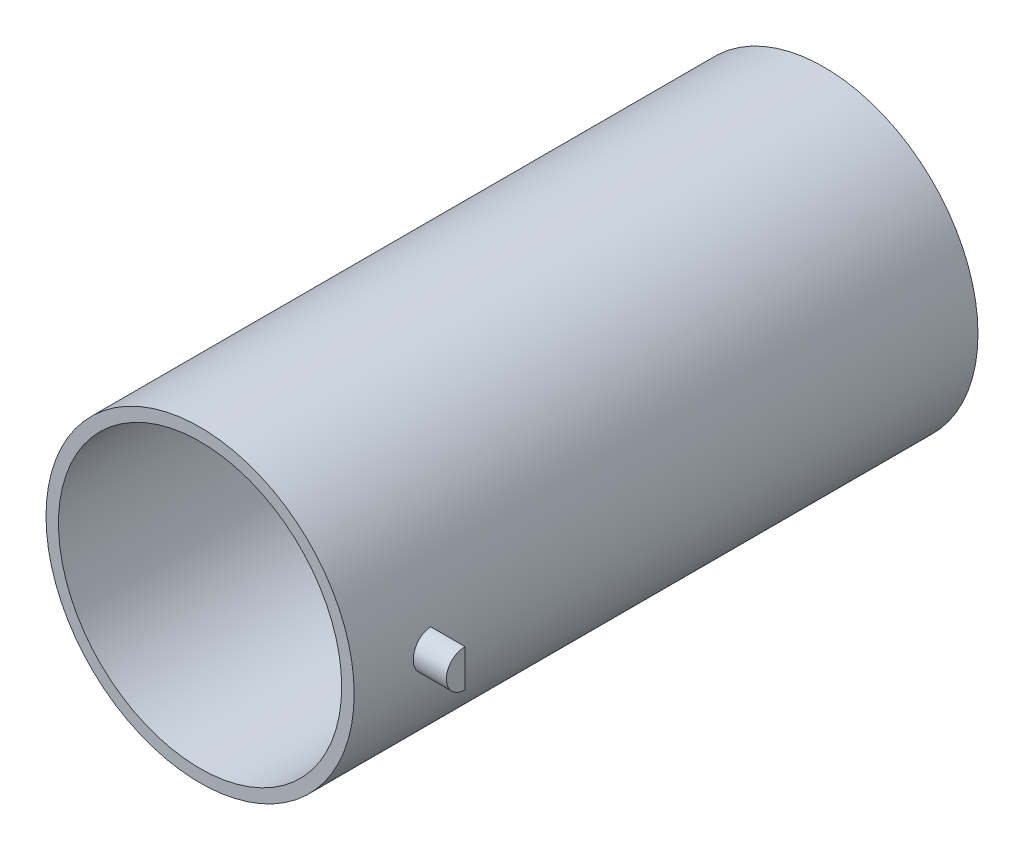
ISO-10303-21;
HEADER;
FILE_DESCRIPTION(('STEP AP214'),'2;1');
FILE_NAME('part.step','',(''),(''),'','','');
FILE_SCHEMA(('AUTOMOTIVE_DESIGN { 1 0 10303 214 1 1 1 1 }'));
ENDSEC;
DATA;
#1=APPLICATION_CONTEXT('core data for automotive mechanical design processes');
#2=APPLICATION_PROTOCOL_DEFINITION('international standard','automotive_design',2000,#1);
#3=PRODUCT_CONTEXT('',#1,'mechanical');
#4=PRODUCT('Part','Part','',(#3));
#5=PRODUCT_RELATED_PRODUCT_CATEGORY('part','',(#4));
#6=PRODUCT_DEFINITION_FORMATION('','',#4);
#7=PRODUCT_DEFINITION_CONTEXT('part definition',#1,'design');
#8=PRODUCT_DEFINITION('design','',#6,#7);
#9=PRODUCT_DEFINITION_SHAPE('','',#8);
#10=(LENGTH_UNIT() NAMED_UNIT(*) SI_UNIT(.MILLI.,.METRE.));
#11=(NAMED_UNIT(*) PLANE_ANGLE_UNIT() SI_UNIT($,.RADIAN.));
#12=(NAMED_UNIT(*) SI_UNIT($,.STERADIAN.) SOLID_ANGLE_UNIT());
#13=UNCERTAINTY_MEASURE_WITH_UNIT(LENGTH_MEASURE(1.E-05),#10,'distance_accuracy_value','');
#14=(GEOMETRIC_REPRESENTATION_CONTEXT(3) GLOBAL_UNCERTAINTY_ASSIGNED_CONTEXT((#13)) GLOBAL_UNIT_ASSIGNED_CONTEXT((#10,
#11,#12)) REPRESENTATION_CONTEXT('',''));
#15=CARTESIAN_POINT('',(0.,0.,0.));
#16=DIRECTION('',(0.,0.,1.));
#17=DIRECTION('',(1.,0.,0.));
#18=AXIS2_PLACEMENT_3D('',#15,#16,#17);
#19=CARTESIAN_POINT('',(0.,0.,127.));
#20=DIRECTION('',(0.,0.,-1.));
#21=DIRECTION('',(-1.,0.,0.));
#22=AXIS2_PLACEMENT_3D('',#19,#20,#21);
#23=CYLINDRICAL_SURFACE('',#22,31.369);
#24=CARTESIAN_POINT('',(31.369,0.,114.971571782048));
#25=CARTESIAN_POINT('',(31.3689970955781,-0.213167364051595,114.971562696366));
#26=CARTESIAN_POINT('',(31.3668041688606,-0.426469134178788,114.953621584882));
#27=CARTESIAN_POINT('',(31.3582670744274,-0.847140611326079,114.882332263245));
#28=CARTESIAN_POINT('',(31.3519185351752,-1.05450383120011,114.828946766184));
#29=CARTESIAN_POINT('',(31.3357856363385,-1.4571469626942,114.688361817618));
#30=CARTESIAN_POINT('',(31.3260035532145,-1.65243477972668,114.601184766134));
#31=CARTESIAN_POINT('',(31.3040924359266,-2.02557016512767,114.395539517755));
#32=CARTESIAN_POINT('',(31.291963814335,-2.20342079106323,114.277076820223));
#33=CARTESIAN_POINT('',(31.2666438013514,-2.53759790009,114.011562760453));
#34=CARTESIAN_POINT('',(31.253447731094,-2.69382046896116,113.864381044467));
#35=CARTESIAN_POINT('',(31.2275179720887,-2.97941219391668,113.545886574842));
#36=CARTESIAN_POINT('',(31.2147843065805,-3.10878000186274,113.374572610462));
#37=CARTESIAN_POINT('',(31.1911748513728,-3.33737435755847,113.012004774136));
#38=CARTESIAN_POINT('',(31.1803050818292,-3.43650401390402,112.820689387646));
#39=CARTESIAN_POINT('',(31.1617153825556,-3.6011893919571,112.423972878325));
#40=CARTESIAN_POINT('',(31.1539953399082,-3.66674631726484,112.218572260756));
#41=CARTESIAN_POINT('',(31.142623578278,-3.76211060558043,111.800591925058));
#42=CARTESIAN_POINT('',(31.1389519443873,-3.79209302247592,111.588052697548));
#43=CARTESIAN_POINT('',(31.1360316605245,-3.8159987951884,111.160929913887));
#44=CARTESIAN_POINT('',(31.1367828422859,-3.80992352282403,110.94634643582));
#45=CARTESIAN_POINT('',(31.1426050935601,-3.76203015742701,110.522444301279));
#46=CARTESIAN_POINT('',(31.1476528891808,-3.7204046288957,110.313103523438));
#47=CARTESIAN_POINT('',(31.1614633040205,-3.60289266751102,109.904400777028));
#48=CARTESIAN_POINT('',(31.1702259946537,-3.52700557602057,109.705039000375));
#49=CARTESIAN_POINT('',(31.1905053216013,-3.34291680592955,109.321353620315));
#50=CARTESIAN_POINT('',(31.2020290968153,-3.23463117599408,109.137070688699));
#51=CARTESIAN_POINT('',(31.2265265642595,-2.98887925657692,108.78921969431));
#52=CARTESIAN_POINT('',(31.2395003191065,-2.85141170665659,108.625652526788));
#53=CARTESIAN_POINT('',(31.2655394389436,-2.55012965719149,108.322758226094));
#54=CARTESIAN_POINT('',(31.2786048494192,-2.38614912658694,108.183596190874));
#55=CARTESIAN_POINT('',(31.3032758453628,-2.03706833621165,107.93474703181));
#56=CARTESIAN_POINT('',(31.3148814277768,-1.85196803225926,107.825059969628));
#57=CARTESIAN_POINT('',(31.3353317713395,-1.46577669593737,107.638275293854));
#58=CARTESIAN_POINT('',(31.3441756822835,-1.26468076303405,107.561187713715));
#59=CARTESIAN_POINT('',(31.3580983812159,-0.852267813359166,107.441919735353));
#60=CARTESIAN_POINT('',(31.363177335567,-0.640951248648288,107.399737794738));
#61=CARTESIAN_POINT('',(31.3689762787509,-0.215523396717518,107.351691762585));
#62=CARTESIAN_POINT('',(31.3697235710167,-0.00143815874187753,107.345600180067));
#63=CARTESIAN_POINT('',(31.3668486306061,0.424702131578445,107.369307871813));
#64=CARTESIAN_POINT('',(31.3632264856713,0.636757224603814,107.399106425375));
#65=CARTESIAN_POINT('',(31.3520367343606,1.05214877665922,107.493559567637));
#66=CARTESIAN_POINT('',(31.3444813742867,1.25551018933141,107.558105987913));
#67=CARTESIAN_POINT('',(31.3262713206488,1.64852160489971,107.720110370148));
#68=CARTESIAN_POINT('',(31.3156165272328,1.83817116580638,107.817569392442));
#69=CARTESIAN_POINT('',(31.2923279996241,2.19939336582821,108.04318500586));
#70=CARTESIAN_POINT('',(31.279684860002,2.37087325259756,108.171489110906));
#71=CARTESIAN_POINT('',(31.2538641968051,2.68994549408777,108.454943681751));
#72=CARTESIAN_POINT('',(31.2406866532592,2.8375369550456,108.610095151568));
#73=CARTESIAN_POINT('',(31.2151984492689,3.10544723955395,108.943840916483));
#74=CARTESIAN_POINT('',(31.2028928191322,3.22561549187931,109.12255652063));
#75=CARTESIAN_POINT('',(31.1806235764868,3.43422881311563,109.497767329609));
#76=CARTESIAN_POINT('',(31.1706599192583,3.52267448778491,109.694262194849));
#77=CARTESIAN_POINT('',(31.15423662668,3.66508694321304,110.098963206997));
#78=CARTESIAN_POINT('',(31.1477682962238,3.71913934205776,110.307138857441));
#79=CARTESIAN_POINT('',(31.1390427977439,3.79150695747354,110.729695193466));
#80=CARTESIAN_POINT('',(31.1367854456211,3.80982373636615,110.944075607367));
#81=CARTESIAN_POINT('',(31.1367426383494,3.81017259067306,111.371458271235));
#82=CARTESIAN_POINT('',(31.1389280304988,3.79244120932643,111.584460364024));
#83=CARTESIAN_POINT('',(31.1474618780662,3.72169721326812,112.004433478009));
#84=CARTESIAN_POINT('',(31.1538103346845,3.66868458838558,112.211404497466));
#85=CARTESIAN_POINT('',(31.1699461292312,3.52895559782069,112.613413656303));
#86=CARTESIAN_POINT('',(31.179732373105,3.44224995380232,112.80845556889));
#87=CARTESIAN_POINT('',(31.2016429542723,3.23761953079512,113.181259100314));
#88=CARTESIAN_POINT('',(31.2137673143747,3.11969444724996,113.359020550551));
#89=CARTESIAN_POINT('',(31.239083370723,2.85509302836648,113.693427024122));
#90=CARTESIAN_POINT('',(31.2522813068443,2.70824033379213,113.849932038452));
#91=CARTESIAN_POINT('',(31.2782020012869,2.39031840634084,114.136170008032));
#92=CARTESIAN_POINT('',(31.2909246465852,2.21924345922273,114.265896628225));
#93=CARTESIAN_POINT('',(31.3145114549127,1.85703116144723,114.495289023414));
#94=CARTESIAN_POINT('',(31.3253687682306,1.66582385841211,114.594844988873));
#95=CARTESIAN_POINT('',(31.3439316042907,1.26938229844139,114.760294378611));
#96=CARTESIAN_POINT('',(31.3516405699763,1.06416365222346,114.826224594798));
#97=CARTESIAN_POINT('',(31.3611675226217,0.714889337163812,114.906666709973));
#98=CARTESIAN_POINT('',(31.3640904880335,0.573041222199046,114.930971402178));
#99=CARTESIAN_POINT('',(31.3680076995963,0.287482442988227,114.963426947069));
#100=CARTESIAN_POINT('',(31.3690019589019,0.143771791452228,114.971577909932));
#101=CARTESIAN_POINT('',(31.369,0.,114.971571782048));
#102=B_SPLINE_CURVE_WITH_KNOTS('',3,(#24,#25,#26,#27,#28,#29,#30,#31,#32,#33,#34,#35,#36,#37,
#38,#39,#40,#41,#42,#43,#44,#45,#46,#47,#48,#49,#50,#51,#52,#53,#54,#55,#56,#57,#58,#59,#60,#61,
#62,#63,#64,#65,#66,#67,#68,#69,#70,#71,#72,#73,#74,#75,#76,#77,#78,#79,#80,#81,#82,#83,#84,#85,
#86,#87,#88,#89,#90,#91,#92,#93,#94,#95,#96,#97,#98,#99,#100,#101),.UNSPECIFIED.,.T.,.F.,(4,2,2,
2,2,2,2,2,2,2,2,2,2,2,2,2,2,2,2,2,2,2,2,2,2,2,2,2,2,2,2,2,2,2,2,2,2,2,4),(0.,0.63897696331118,
1.27862718717995,1.9178541176241,2.55696876003608,3.19905477212243,3.84117300983587,
4.48532766669679,5.1294592286547,5.7704078471223,6.41133208078783,7.04880649035596,
7.68629315511984,8.32544620084571,8.96462685877694,9.60797738901365,10.2513292651359,
10.8948790079109,11.5384003123299,12.1778609096841,12.8173086663914,13.4547772674503,
14.0922664075942,14.7328671529878,15.3734918603197,16.0175536383617,16.6616031170699,
17.3040429709352,17.946454737415,18.5846646904379,19.2228748274439,19.8608820417452,
20.4988954802549,21.1409262224824,21.7831086785175,22.4276011108777,23.0713868451585,
23.502350983125,23.9333121817151),.UNSPECIFIED.);
#103=CARTESIAN_POINT('',(31.13676381707,3.81,111.161571782048));
#104=VERTEX_POINT('',#103);
#105=CARTESIAN_POINT('',(31.13676381707,-3.81,111.161571782048));
#106=VERTEX_POINT('',#105);
#107=EDGE_CURVE('E112',#104,#106,#102,.T.);
#108=ORIENTED_EDGE('',*,*,#107,.F.);
#109=CARTESIAN_POINT('',(0.,0.,111.161571782048));
#110=DIRECTION('',(0.,0.,1.));
#111=DIRECTION('',(1.,0.,0.));
#112=AXIS2_PLACEMENT_3D('',#109,#110,#111);
#113=CIRCLE('',#112,31.369);
#114=EDGE_CURVE('E57',#106,#104,#113,.T.);
#115=ORIENTED_EDGE('',*,*,#114,.F.);
#116=EDGE_LOOP('',(#108,#115));
#117=FACE_BOUND('',#116,.T.);
#118=CARTESIAN_POINT('',(0.,0.,127.));
#119=DIRECTION('',(0.,0.,1.));
#120=DIRECTION('',(1.,0.,0.));
#121=AXIS2_PLACEMENT_3D('',#118,#119,#120);
#122=CIRCLE('',#121,31.369);
#123=CARTESIAN_POINT('',(31.369,0.,127.));
#124=VERTEX_POINT('',#123);
#125=EDGE_CURVE('E107',#124,#124,#122,.T.);
#126=ORIENTED_EDGE('',*,*,#125,.F.);
#127=EDGE_LOOP('',(#126));
#128=FACE_BOUND('',#127,.T.);
#129=CARTESIAN_POINT('',(0.,0.,0.));
#130=DIRECTION('',(0.,0.,1.));
#131=DIRECTION('',(1.,0.,0.));
#132=AXIS2_PLACEMENT_3D('',#129,#130,#131);
#133=CIRCLE('',#132,31.369);
#134=CARTESIAN_POINT('',(31.369,0.,0.));
#135=VERTEX_POINT('',#134);
#136=EDGE_CURVE('E106',#135,#135,#133,.T.);
#137=ORIENTED_EDGE('',*,*,#136,.T.);
#138=EDGE_LOOP('',(#137));
#139=FACE_BOUND('',#138,.T.);
#140=CARTESIAN_POINT('',(-31.369,0.,114.971571782048));
#141=CARTESIAN_POINT('',(-31.3689970955781,0.213167364051582,114.971562696366));
#142=CARTESIAN_POINT('',(-31.3668041688606,0.426469134178775,114.953621584882));
#143=CARTESIAN_POINT('',(-31.3582670744275,0.847140611326068,114.882332263245));
#144=CARTESIAN_POINT('',(-31.3519185351752,1.0545038312001,114.828946766184));
#145=CARTESIAN_POINT('',(-31.3357856363385,1.45714696269418,114.688361817618));
#146=CARTESIAN_POINT('',(-31.3260035532146,1.65243477972666,114.601184766134));
#147=CARTESIAN_POINT('',(-31.3040924359266,2.02557016512765,114.395539517755));
#148=CARTESIAN_POINT('',(-31.291963814335,2.20342079106321,114.277076820223));
#149=CARTESIAN_POINT('',(-31.2666438013514,2.53759790008999,114.011562760453));
#150=CARTESIAN_POINT('',(-31.253447731094,2.69382046896115,113.864381044467));
#151=CARTESIAN_POINT('',(-31.2275179720887,2.97941219391666,113.545886574842));
#152=CARTESIAN_POINT('',(-31.2147843065805,3.10878000186272,113.374572610462));
#153=CARTESIAN_POINT('',(-31.1911748513728,3.33737435755846,113.012004774136));
#154=CARTESIAN_POINT('',(-31.1803050818292,3.436504013904,112.820689387646));
#155=CARTESIAN_POINT('',(-31.1617153825556,3.60118939195708,112.423972878325));
#156=CARTESIAN_POINT('',(-31.1539953399082,3.66674631726482,112.218572260756));
#157=CARTESIAN_POINT('',(-31.1426235782781,3.76211060558041,111.800591925058));
#158=CARTESIAN_POINT('',(-31.1389519443873,3.7920930224759,111.588052697548));
#159=CARTESIAN_POINT('',(-31.1360316605245,3.81599879518838,111.160929913887));
#160=CARTESIAN_POINT('',(-31.1367828422859,3.809923522824,110.94634643582));
#161=CARTESIAN_POINT('',(-31.1426050935601,3.76203015742698,110.522444301279));
#162=CARTESIAN_POINT('',(-31.1476528891808,3.72040462889567,110.313103523438));
#163=CARTESIAN_POINT('',(-31.1614633040205,3.60289266751099,109.904400777028));
#164=CARTESIAN_POINT('',(-31.1702259946537,3.52700557602053,109.705039000375));
#165=CARTESIAN_POINT('',(-31.1905053216013,3.34291680592951,109.321353620315));
#166=CARTESIAN_POINT('',(-31.2020290968153,3.23463117599404,109.137070688699));
#167=CARTESIAN_POINT('',(-31.2265265642595,2.98887925657688,108.78921969431));
#168=CARTESIAN_POINT('',(-31.2395003191065,2.85141170665655,108.625652526788));
#169=CARTESIAN_POINT('',(-31.2655394389436,2.55012965719145,108.322758226094));
#170=CARTESIAN_POINT('',(-31.2786048494192,2.3861491265869,108.183596190874));
#171=CARTESIAN_POINT('',(-31.3032758453628,2.0370683362116,107.93474703181));
#172=CARTESIAN_POINT('',(-31.3148814277768,1.85196803225922,107.825059969628));
#173=CARTESIAN_POINT('',(-31.3353317713395,1.46577669593732,107.638275293854));
#174=CARTESIAN_POINT('',(-31.3441756822835,1.264680763034,107.561187713715));
#175=CARTESIAN_POINT('',(-31.3580983812159,0.852267813359124,107.441919735353));
#176=CARTESIAN_POINT('',(-31.363177335567,0.640951248648247,107.399737794738));
#177=CARTESIAN_POINT('',(-31.3689762787509,0.215523396717477,107.351691762585));
#178=CARTESIAN_POINT('',(-31.3697235710167,0.00143815874183549,107.345600180067));
#179=CARTESIAN_POINT('',(-31.3668486306061,-0.424702131578489,107.369307871813));
#180=CARTESIAN_POINT('',(-31.3632264856713,-0.636757224603858,107.399106425375));
#181=CARTESIAN_POINT('',(-31.3520367343606,-1.05214877665926,107.493559567637));
#182=CARTESIAN_POINT('',(-31.3444813742868,-1.25551018933145,107.558105987913));
#183=CARTESIAN_POINT('',(-31.3262713206488,-1.64852160489975,107.720110370148));
#184=CARTESIAN_POINT('',(-31.3156165272328,-1.83817116580643,107.817569392442));
#185=CARTESIAN_POINT('',(-31.2923279996241,-2.19939336582825,108.04318500586));
#186=CARTESIAN_POINT('',(-31.279684860002,-2.3708732525976,108.171489110906));
#187=CARTESIAN_POINT('',(-31.2538641968051,-2.68994549408781,108.454943681751));
#188=CARTESIAN_POINT('',(-31.2406866532592,-2.83753695504564,108.610095151568));
#189=CARTESIAN_POINT('',(-31.2151984492689,-3.10544723955398,108.943840916483));
#190=CARTESIAN_POINT('',(-31.2028928191322,-3.22561549187934,109.12255652063));
#191=CARTESIAN_POINT('',(-31.1806235764868,-3.43422881311566,109.497767329609));
#192=CARTESIAN_POINT('',(-31.1706599192583,-3.52267448778495,109.694262194849));
#193=CARTESIAN_POINT('',(-31.15423662668,-3.66508694321307,110.098963206997));
#194=CARTESIAN_POINT('',(-31.1477682962238,-3.71913934205779,110.307138857441));
#195=CARTESIAN_POINT('',(-31.1390427977439,-3.79150695747357,110.729695193466));
#196=CARTESIAN_POINT('',(-31.1367854456211,-3.80982373636618,110.944075607367));
#197=CARTESIAN_POINT('',(-31.1367426383494,-3.81017259067308,111.371458271235));
#198=CARTESIAN_POINT('',(-31.1389280304988,-3.79244120932645,111.584460364024));
#199=CARTESIAN_POINT('',(-31.1474618780662,-3.72169721326814,112.004433478009));
#200=CARTESIAN_POINT('',(-31.1538103346845,-3.6686845883856,112.211404497466));
#201=CARTESIAN_POINT('',(-31.1699461292312,-3.52895559782071,112.613413656303));
#202=CARTESIAN_POINT('',(-31.179732373105,-3.44224995380234,112.80845556889));
#203=CARTESIAN_POINT('',(-31.2016429542723,-3.23761953079514,113.181259100314));
#204=CARTESIAN_POINT('',(-31.2137673143747,-3.11969444724997,113.359020550551));
#205=CARTESIAN_POINT('',(-31.239083370723,-2.8550930283665,113.693427024122));
#206=CARTESIAN_POINT('',(-31.2522813068443,-2.70824033379214,113.849932038452));
#207=CARTESIAN_POINT('',(-31.2782020012869,-2.39031840634085,114.136170008032));
#208=CARTESIAN_POINT('',(-31.2909246465852,-2.21924345922274,114.265896628225));
#209=CARTESIAN_POINT('',(-31.3145114549127,-1.85703116144723,114.495289023414));
#210=CARTESIAN_POINT('',(-31.3253687682306,-1.66582385841212,114.594844988873));
#211=CARTESIAN_POINT('',(-31.3439316042907,-1.2693822984414,114.760294378611));
#212=CARTESIAN_POINT('',(-31.3516405699763,-1.06416365222347,114.826224594798));
#213=CARTESIAN_POINT('',(-31.3611675226217,-0.714889337163828,114.906666709973));
#214=CARTESIAN_POINT('',(-31.3640904880335,-0.573041222199062,114.930971402178));
#215=CARTESIAN_POINT('',(-31.3680076995963,-0.287482442988242,114.963426947069));
#216=CARTESIAN_POINT('',(-31.3690019589019,-0.143771791452242,114.971577909932));
#217=CARTESIAN_POINT('',(-31.369,0.,114.971571782048));
#218=B_SPLINE_CURVE_WITH_KNOTS('',3,(#140,#141,#142,#143,#144,#145,#146,#147,#148,#149,#150,
#151,#152,#153,#154,#155,#156,#157,#158,#159,#160,#161,#162,#163,#164,#165,#166,#167,#168,#169,
#170,#171,#172,#173,#174,#175,#176,#177,#178,#179,#180,#181,#182,#183,#184,#185,#186,#187,#188,
#189,#190,#191,#192,#193,#194,#195,#196,#197,#198,#199,#200,#201,#202,#203,#204,#205,#206,#207,
#208,#209,#210,#211,#212,#213,#214,#215,#216,#217),.UNSPECIFIED.,.T.,.F.,(4,2,2,2,2,2,2,2,2,2,2,
2,2,2,2,2,2,2,2,2,2,2,2,2,2,2,2,2,2,2,2,2,2,2,2,2,2,2,4),(0.,0.638976963311181,1.27862718717996,
1.9178541176241,2.55696876003608,3.19905477212244,3.84117300983588,4.4853276666968,
5.12945922865472,5.77040784712231,6.41133208078784,7.04880649035596,7.68629315511984,
8.32544620084572,8.96462685877695,9.60797738901366,10.2513292651359,10.8948790079109,
11.5384003123299,12.1778609096841,12.8173086663914,13.4547772674503,14.0922664075942,
14.7328671529878,15.3734918603197,16.0175536383616,16.6616031170699,17.3040429709352,
17.946454737415,18.5846646904379,19.2228748274439,19.8608820417453,20.4988954802549,
21.1409262224824,21.7831086785175,22.4276011108777,23.0713868451585,23.502350983125,
23.9333121817151),.UNSPECIFIED.);
#219=CARTESIAN_POINT('',(-31.13676381707,-3.81,111.161571782048));
#220=VERTEX_POINT('',#219);
#221=CARTESIAN_POINT('',(-31.13676381707,3.81,111.161571782048));
#222=VERTEX_POINT('',#221);
#223=EDGE_CURVE('E11',#220,#222,#218,.T.);
#224=ORIENTED_EDGE('',*,*,#223,.F.);
#225=EDGE_CURVE('E46',#222,#220,#113,.T.);
#226=ORIENTED_EDGE('',*,*,#225,.F.);
#227=EDGE_LOOP('',(#224,#226));
#228=FACE_BOUND('',#227,.T.);
#229=ADVANCED_FACE('F35',(#117,#128,#139,#228),#23,.T.);
#230=CARTESIAN_POINT('',(0.,0.,127.));
#231=DIRECTION('',(0.,0.,1.));
#232=DIRECTION('',(1.,0.,0.));
#233=AXIS2_PLACEMENT_3D('',#230,#231,#232);
#234=PLANE('',#233);
#235=CARTESIAN_POINT('',(0.,0.,127.));
#236=DIRECTION('',(0.,0.,1.));
#237=DIRECTION('',(1.,0.,0.));
#238=AXIS2_PLACEMENT_3D('',#235,#236,#237);
#239=CIRCLE('',#238,28.829);
#240=CARTESIAN_POINT('',(28.829,0.,127.));
#241=VERTEX_POINT('',#240);
#242=EDGE_CURVE('E92',#241,#241,#239,.T.);
#243=ORIENTED_EDGE('',*,*,#242,.F.);
#244=EDGE_LOOP('',(#243));
#245=FACE_BOUND('',#244,.T.);
#246=ORIENTED_EDGE('',*,*,#125,.T.);
#247=EDGE_LOOP('',(#246));
#248=FACE_BOUND('',#247,.T.);
#249=ADVANCED_FACE('F122',(#245,#248),#234,.T.);
#250=CARTESIAN_POINT('',(0.,0.,0.));
#251=DIRECTION('',(0.,0.,1.));
#252=DIRECTION('',(1.,0.,0.));
#253=AXIS2_PLACEMENT_3D('',#250,#251,#252);
#254=PLANE('',#253);
#255=ORIENTED_EDGE('',*,*,#136,.F.);
#256=EDGE_LOOP('',(#255));
#257=FACE_BOUND('',#256,.T.);
#258=ADVANCED_FACE('F125',(#257),#254,.F.);
#259=CARTESIAN_POINT('',(38.1,0.,111.161571782048));
#260=DIRECTION('',(1.,0.,0.));
#261=DIRECTION('',(0.,0.,-1.));
#262=AXIS2_PLACEMENT_3D('',#259,#260,#261);
#263=PLANE('',#262);
#264=CARTESIAN_POINT('',(38.1,0.,111.161571782048));
#265=DIRECTION('',(1.,0.,0.));
#266=DIRECTION('',(0.,0.,-1.));
#267=AXIS2_PLACEMENT_3D('',#264,#265,#266);
#268=CIRCLE('',#267,3.81);
#269=CARTESIAN_POINT('',(38.1,3.81,111.161571782048));
#270=VERTEX_POINT('',#269);
#271=CARTESIAN_POINT('',(38.1,-3.81,111.161571782048));
#272=VERTEX_POINT('',#271);
#273=EDGE_CURVE('E95',#270,#272,#268,.T.);
#274=ORIENTED_EDGE('',*,*,#273,.T.);
#275=DIRECTION('',(0.,1.,0.));
#276=VECTOR('',#275,1.);
#277=CARTESIAN_POINT('',(38.1,3.81,111.161571782048));
#278=LINE('',#277,#276);
#279=EDGE_CURVE('E98',#272,#270,#278,.T.);
#280=ORIENTED_EDGE('',*,*,#279,.T.);
#281=EDGE_LOOP('',(#274,#280));
#282=FACE_BOUND('',#281,.T.);
#283=ADVANCED_FACE('F128',(#282),#263,.T.);
#284=CARTESIAN_POINT('',(38.1,3.81,111.161571782048));
#285=DIRECTION('',(0.,0.,1.));
#286=DIRECTION('',(1.,0.,0.));
#287=AXIS2_PLACEMENT_3D('',#284,#285,#286);
#288=PLANE('',#287);
#289=DIRECTION('',(-1.,0.,0.));
#290=VECTOR('',#289,1.);
#291=CARTESIAN_POINT('',(38.1,-3.81,111.161571782048));
#292=LINE('',#291,#290);
#293=EDGE_CURVE('E84',#272,#106,#292,.T.);
#294=ORIENTED_EDGE('',*,*,#293,.T.);
#295=ORIENTED_EDGE('',*,*,#114,.T.);
#296=DIRECTION('',(-1.,0.,0.));
#297=VECTOR('',#296,1.);
#298=CARTESIAN_POINT('',(38.1,3.81,111.161571782048));
#299=LINE('',#298,#297);
#300=EDGE_CURVE('E85',#270,#104,#299,.T.);
#301=ORIENTED_EDGE('',*,*,#300,.F.);
#302=ORIENTED_EDGE('',*,*,#279,.F.);
#303=EDGE_LOOP('',(#294,#295,#301,#302));
#304=FACE_BOUND('',#303,.T.);
#305=ADVANCED_FACE('F120',(#304),#288,.F.);
#306=CARTESIAN_POINT('',(38.1,0.,111.161571782048));
#307=DIRECTION('',(-1.,0.,0.));
#308=DIRECTION('',(0.,0.,1.));
#309=AXIS2_PLACEMENT_3D('',#306,#307,#308);
#310=CYLINDRICAL_SURFACE('',#309,3.81);
#311=ORIENTED_EDGE('',*,*,#300,.T.);
#312=ORIENTED_EDGE('',*,*,#107,.T.);
#313=ORIENTED_EDGE('',*,*,#293,.F.);
#314=ORIENTED_EDGE('',*,*,#273,.F.);
#315=EDGE_LOOP('',(#311,#312,#313,#314));
#316=FACE_BOUND('',#315,.T.);
#317=ADVANCED_FACE('F119',(#316),#310,.T.);
#318=CARTESIAN_POINT('',(-38.1,-3.81,111.161571782048));
#319=VERTEX_POINT('',#318);
#320=EDGE_CURVE('E77',#220,#319,#292,.T.);
#321=ORIENTED_EDGE('',*,*,#320,.F.);
#322=ORIENTED_EDGE('',*,*,#223,.T.);
#323=CARTESIAN_POINT('',(-38.1,3.81,111.161571782048));
#324=VERTEX_POINT('',#323);
#325=EDGE_CURVE('E90',#222,#324,#299,.T.);
#326=ORIENTED_EDGE('',*,*,#325,.T.);
#327=CARTESIAN_POINT('',(-38.1,0.,111.161571782048));
#328=DIRECTION('',(1.,0.,0.));
#329=DIRECTION('',(0.,0.,-1.));
#330=AXIS2_PLACEMENT_3D('',#327,#328,#329);
#331=CIRCLE('',#330,3.81);
#332=EDGE_CURVE('E88',#324,#319,#331,.T.);
#333=ORIENTED_EDGE('',*,*,#332,.T.);
#334=EDGE_LOOP('',(#321,#322,#326,#333));
#335=FACE_BOUND('',#334,.T.);
#336=ADVANCED_FACE('F89',(#335),#310,.T.);
#337=ORIENTED_EDGE('',*,*,#325,.F.);
#338=ORIENTED_EDGE('',*,*,#225,.T.);
#339=ORIENTED_EDGE('',*,*,#320,.T.);
#340=DIRECTION('',(0.,1.,0.));
#341=VECTOR('',#340,1.);
#342=CARTESIAN_POINT('',(-38.1,3.81,111.161571782048));
#343=LINE('',#342,#341);
#344=EDGE_CURVE('E82',#319,#324,#343,.T.);
#345=ORIENTED_EDGE('',*,*,#344,.T.);
#346=EDGE_LOOP('',(#337,#338,#339,#345));
#347=FACE_BOUND('',#346,.T.);
#348=ADVANCED_FACE('F80',(#347),#288,.F.);
#349=CARTESIAN_POINT('',(-38.1,0.,111.161571782048));
#350=DIRECTION('',(1.,0.,0.));
#351=DIRECTION('',(0.,0.,-1.));
#352=AXIS2_PLACEMENT_3D('',#349,#350,#351);
#353=PLANE('',#352);
#354=ORIENTED_EDGE('',*,*,#332,.F.);
#355=ORIENTED_EDGE('',*,*,#344,.F.);
#356=EDGE_LOOP('',(#354,#355));
#357=FACE_BOUND('',#356,.T.);
#358=ADVANCED_FACE('F94',(#357),#353,.F.);
#359=CARTESIAN_POINT('',(0.,0.,127.));
#360=DIRECTION('',(0.,0.,-1.));
#361=DIRECTION('',(-1.,0.,0.));
#362=AXIS2_PLACEMENT_3D('',#359,#360,#361);
#363=CYLINDRICAL_SURFACE('',#362,28.829);
#364=ORIENTED_EDGE('',*,*,#242,.T.);
#365=EDGE_LOOP('',(#364));
#366=FACE_BOUND('',#365,.T.);
#367=CARTESIAN_POINT('',(0.,0.,2.54));
#368=DIRECTION('',(0.,0.,1.));
#369=DIRECTION('',(1.,0.,0.));
#370=AXIS2_PLACEMENT_3D('',#367,#368,#369);
#371=CIRCLE('',#370,28.829);
#372=CARTESIAN_POINT('',(28.829,0.,2.54));
#373=VERTEX_POINT('',#372);
#374=EDGE_CURVE('E172',#373,#373,#371,.T.);
#375=ORIENTED_EDGE('',*,*,#374,.F.);
#376=EDGE_LOOP('',(#375));
#377=FACE_BOUND('',#376,.T.);
#378=ADVANCED_FACE('F157',(#366,#377),#363,.F.);
#379=CARTESIAN_POINT('',(0.,0.,2.54));
#380=DIRECTION('',(0.,0.,1.));
#381=DIRECTION('',(1.,0.,0.));
#382=AXIS2_PLACEMENT_3D('',#379,#380,#381);
#383=PLANE('',#382);
#384=ORIENTED_EDGE('',*,*,#374,.T.);
#385=EDGE_LOOP('',(#384));
#386=FACE_BOUND('',#385,.T.);
#387=ADVANCED_FACE('F162',(#386),#383,.T.);
#388=CLOSED_SHELL('',(#229,#249,#258,#283,#305,#317,#336,#348,#358,#378,#387));
#389=MANIFOLD_SOLID_BREP('B2',#388);
#390=ADVANCED_BREP_SHAPE_REPRESENTATION('',(#18,#389),#14);
#391=SHAPE_DEFINITION_REPRESENTATION(#9,#390);
ENDSEC;
END-ISO-10303-21;
